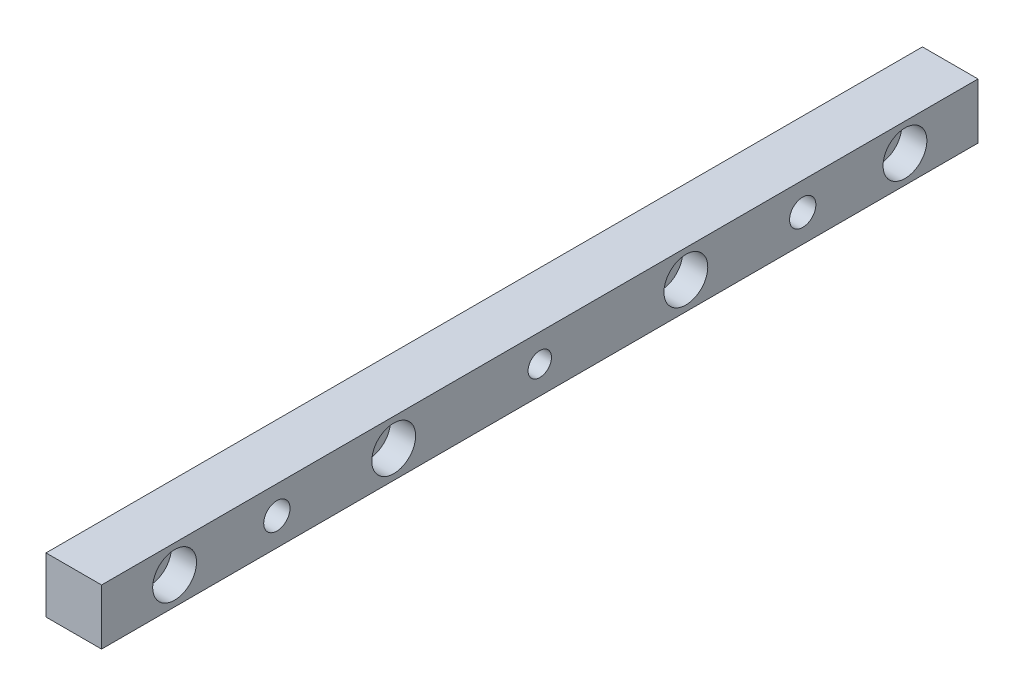
ISO-10303-21;
HEADER;
FILE_DESCRIPTION(('STEP AP214'),'2;1');
FILE_NAME('part.step','',(''),(''),'','','');
FILE_SCHEMA(('AUTOMOTIVE_DESIGN { 1 0 10303 214 1 1 1 1 }'));
ENDSEC;
DATA;
#1=APPLICATION_CONTEXT('core data for automotive mechanical design processes');
#2=APPLICATION_PROTOCOL_DEFINITION('international standard','automotive_design',2000,#1);
#3=PRODUCT_CONTEXT('',#1,'mechanical');
#4=PRODUCT('Part','Part','',(#3));
#5=PRODUCT_RELATED_PRODUCT_CATEGORY('part','',(#4));
#6=PRODUCT_DEFINITION_FORMATION('','',#4);
#7=PRODUCT_DEFINITION_CONTEXT('part definition',#1,'design');
#8=PRODUCT_DEFINITION('design','',#6,#7);
#9=PRODUCT_DEFINITION_SHAPE('','',#8);
#10=(LENGTH_UNIT() NAMED_UNIT(*) SI_UNIT(.MILLI.,.METRE.));
#11=(NAMED_UNIT(*) PLANE_ANGLE_UNIT() SI_UNIT($,.RADIAN.));
#12=(NAMED_UNIT(*) SI_UNIT($,.STERADIAN.) SOLID_ANGLE_UNIT());
#13=UNCERTAINTY_MEASURE_WITH_UNIT(LENGTH_MEASURE(1.E-05),#10,'distance_accuracy_value','');
#14=(GEOMETRIC_REPRESENTATION_CONTEXT(3) GLOBAL_UNCERTAINTY_ASSIGNED_CONTEXT((#13)) GLOBAL_UNIT_ASSIGNED_CONTEXT((#10,
#11,#12)) REPRESENTATION_CONTEXT('',''));
#15=CARTESIAN_POINT('',(0.,0.,0.));
#16=DIRECTION('',(0.,0.,1.));
#17=DIRECTION('',(1.,0.,0.));
#18=AXIS2_PLACEMENT_3D('',#15,#16,#17);
#19=CARTESIAN_POINT('',(19.02,3.19,0.));
#20=DIRECTION('',(-1.,0.,0.));
#21=DIRECTION('',(0.,0.,1.));
#22=AXIS2_PLACEMENT_3D('',#19,#20,#21);
#23=CYLINDRICAL_SURFACE('',#22,4.);
#24=CARTESIAN_POINT('',(19.02,3.19,0.));
#25=DIRECTION('',(-1.,0.,0.));
#26=DIRECTION('',(0.,0.,1.));
#27=AXIS2_PLACEMENT_3D('',#24,#25,#26);
#28=CIRCLE('',#27,4.);
#29=CARTESIAN_POINT('',(19.02,3.19,4.));
#30=VERTEX_POINT('',#29);
#31=EDGE_CURVE('E168',#30,#30,#28,.T.);
#32=ORIENTED_EDGE('',*,*,#31,.F.);
#33=EDGE_LOOP('',(#32));
#34=FACE_BOUND('',#33,.T.);
#35=CARTESIAN_POINT('',(8.6,3.19,0.));
#36=DIRECTION('',(-1.,0.,0.));
#37=DIRECTION('',(0.,0.,1.));
#38=AXIS2_PLACEMENT_3D('',#35,#36,#37);
#39=CIRCLE('',#38,4.);
#40=CARTESIAN_POINT('',(8.6,3.19,4.));
#41=VERTEX_POINT('',#40);
#42=EDGE_CURVE('E45',#41,#41,#39,.F.);
#43=ORIENTED_EDGE('',*,*,#42,.F.);
#44=EDGE_LOOP('',(#43));
#45=FACE_BOUND('',#44,.T.);
#46=ADVANCED_FACE('F41',(#34,#45),#23,.F.);
#47=CARTESIAN_POINT('',(19.02,0.,0.));
#48=DIRECTION('',(-1.,0.,0.));
#49=DIRECTION('',(0.,0.,1.));
#50=AXIS2_PLACEMENT_3D('',#47,#48,#49);
#51=PLANE('',#50);
#52=CARTESIAN_POINT('',(19.02,3.19,-90.));
#53=DIRECTION('',(-1.,0.,0.));
#54=DIRECTION('',(0.,0.,1.));
#55=AXIS2_PLACEMENT_3D('',#52,#53,#54);
#56=CIRCLE('',#55,4.5);
#57=CARTESIAN_POINT('',(19.02,3.19,-85.5));
#58=VERTEX_POINT('',#57);
#59=EDGE_CURVE('E183',#58,#58,#56,.T.);
#60=ORIENTED_EDGE('',*,*,#59,.T.);
#61=EDGE_LOOP('',(#60));
#62=FACE_BOUND('',#61,.T.);
#63=CARTESIAN_POINT('',(19.02,3.19,90.));
#64=DIRECTION('',(-1.,0.,0.));
#65=DIRECTION('',(0.,0.,1.));
#66=AXIS2_PLACEMENT_3D('',#63,#64,#65);
#67=CIRCLE('',#66,4.5);
#68=CARTESIAN_POINT('',(19.02,3.19,94.5));
#69=VERTEX_POINT('',#68);
#70=EDGE_CURVE('E171',#69,#69,#67,.T.);
#71=ORIENTED_EDGE('',*,*,#70,.T.);
#72=EDGE_LOOP('',(#71));
#73=FACE_BOUND('',#72,.T.);
#74=ORIENTED_EDGE('',*,*,#31,.T.);
#75=EDGE_LOOP('',(#74));
#76=FACE_BOUND('',#75,.T.);
#77=CARTESIAN_POINT('',(19.02,3.19,125.));
#78=DIRECTION('',(1.,0.,0.));
#79=DIRECTION('',(0.,0.,-1.));
#80=AXIS2_PLACEMENT_3D('',#77,#78,#79);
#81=CIRCLE('',#80,7.5);
#82=CARTESIAN_POINT('',(19.02,3.19,117.5));
#83=VERTEX_POINT('',#82);
#84=EDGE_CURVE('E165',#83,#83,#81,.T.);
#85=ORIENTED_EDGE('',*,*,#84,.F.);
#86=EDGE_LOOP('',(#85));
#87=FACE_BOUND('',#86,.T.);
#88=CARTESIAN_POINT('',(19.02,3.19,50.));
#89=DIRECTION('',(1.,0.,0.));
#90=DIRECTION('',(0.,0.,-1.));
#91=AXIS2_PLACEMENT_3D('',#88,#89,#90);
#92=CIRCLE('',#91,7.5);
#93=CARTESIAN_POINT('',(19.02,3.19,42.5));
#94=VERTEX_POINT('',#93);
#95=EDGE_CURVE('E153',#94,#94,#92,.T.);
#96=ORIENTED_EDGE('',*,*,#95,.F.);
#97=EDGE_LOOP('',(#96));
#98=FACE_BOUND('',#97,.T.);
#99=CARTESIAN_POINT('',(19.02,3.19,-50.));
#100=DIRECTION('',(1.,0.,0.));
#101=DIRECTION('',(0.,0.,-1.));
#102=AXIS2_PLACEMENT_3D('',#99,#100,#101);
#103=CIRCLE('',#102,7.5);
#104=CARTESIAN_POINT('',(19.02,3.19,-57.5));
#105=VERTEX_POINT('',#104);
#106=EDGE_CURVE('E141',#105,#105,#103,.T.);
#107=ORIENTED_EDGE('',*,*,#106,.F.);
#108=EDGE_LOOP('',(#107));
#109=FACE_BOUND('',#108,.T.);
#110=CARTESIAN_POINT('',(19.02,3.19,-125.));
#111=DIRECTION('',(1.,0.,0.));
#112=DIRECTION('',(0.,0.,-1.));
#113=AXIS2_PLACEMENT_3D('',#110,#111,#112);
#114=CIRCLE('',#113,7.5);
#115=CARTESIAN_POINT('',(19.02,3.19,-132.5));
#116=VERTEX_POINT('',#115);
#117=EDGE_CURVE('E129',#116,#116,#114,.T.);
#118=ORIENTED_EDGE('',*,*,#117,.F.);
#119=EDGE_LOOP('',(#118));
#120=FACE_BOUND('',#119,.T.);
#121=DIRECTION('',(0.,1.,0.));
#122=VECTOR('',#121,1.);
#123=CARTESIAN_POINT('',(19.02,-6.32,-150.));
#124=LINE('',#123,#122);
#125=CARTESIAN_POINT('',(19.02,-6.32,-150.));
#126=VERTEX_POINT('',#125);
#127=CARTESIAN_POINT('',(19.02,12.7,-150.));
#128=VERTEX_POINT('',#127);
#129=EDGE_CURVE('E94',#126,#128,#124,.T.);
#130=ORIENTED_EDGE('',*,*,#129,.T.);
#131=DIRECTION('',(0.,0.,1.));
#132=VECTOR('',#131,1.);
#133=CARTESIAN_POINT('',(19.02,12.7,150.));
#134=LINE('',#133,#132);
#135=CARTESIAN_POINT('',(19.02,12.7,150.));
#136=VERTEX_POINT('',#135);
#137=EDGE_CURVE('E89',#128,#136,#134,.T.);
#138=ORIENTED_EDGE('',*,*,#137,.T.);
#139=DIRECTION('',(0.,-1.,0.));
#140=VECTOR('',#139,1.);
#141=CARTESIAN_POINT('',(19.02,-6.32,150.));
#142=LINE('',#141,#140);
#143=CARTESIAN_POINT('',(19.02,-6.32,150.));
#144=VERTEX_POINT('',#143);
#145=EDGE_CURVE('E92',#136,#144,#142,.T.);
#146=ORIENTED_EDGE('',*,*,#145,.T.);
#147=DIRECTION('',(0.,0.,-1.));
#148=VECTOR('',#147,1.);
#149=CARTESIAN_POINT('',(19.02,-6.32,150.));
#150=LINE('',#149,#148);
#151=EDGE_CURVE('E59',#144,#126,#150,.T.);
#152=ORIENTED_EDGE('',*,*,#151,.T.);
#153=EDGE_LOOP('',(#130,#138,#146,#152));
#154=FACE_BOUND('',#153,.T.);
#155=ADVANCED_FACE('F90',(#62,#73,#76,#87,#98,#109,#120,#154),#51,.F.);
#156=CARTESIAN_POINT('',(0.,0.,0.));
#157=DIRECTION('',(-1.,0.,0.));
#158=DIRECTION('',(0.,0.,1.));
#159=AXIS2_PLACEMENT_3D('',#156,#157,#158);
#160=PLANE('',#159);
#161=CARTESIAN_POINT('',(0.,3.19,0.));
#162=DIRECTION('',(-1.,0.,0.));
#163=DIRECTION('',(0.,0.,1.));
#164=AXIS2_PLACEMENT_3D('',#161,#162,#163);
#165=CIRCLE('',#164,7.5);
#166=CARTESIAN_POINT('',(0.,3.19,7.5));
#167=VERTEX_POINT('',#166);
#168=EDGE_CURVE('E195',#167,#167,#165,.T.);
#169=ORIENTED_EDGE('',*,*,#168,.F.);
#170=EDGE_LOOP('',(#169));
#171=FACE_BOUND('',#170,.T.);
#172=CARTESIAN_POINT('',(0.,3.19,-90.));
#173=DIRECTION('',(-1.,0.,0.));
#174=DIRECTION('',(0.,0.,1.));
#175=AXIS2_PLACEMENT_3D('',#172,#173,#174);
#176=CIRCLE('',#175,7.5);
#177=CARTESIAN_POINT('',(0.,3.19,-82.5));
#178=VERTEX_POINT('',#177);
#179=EDGE_CURVE('E192',#178,#178,#176,.T.);
#180=ORIENTED_EDGE('',*,*,#179,.F.);
#181=EDGE_LOOP('',(#180));
#182=FACE_BOUND('',#181,.T.);
#183=CARTESIAN_POINT('',(0.,3.19,90.));
#184=DIRECTION('',(-1.,0.,0.));
#185=DIRECTION('',(0.,0.,1.));
#186=AXIS2_PLACEMENT_3D('',#183,#184,#185);
#187=CIRCLE('',#186,7.5);
#188=CARTESIAN_POINT('',(0.,3.19,97.5));
#189=VERTEX_POINT('',#188);
#190=EDGE_CURVE('E180',#189,#189,#187,.T.);
#191=ORIENTED_EDGE('',*,*,#190,.F.);
#192=EDGE_LOOP('',(#191));
#193=FACE_BOUND('',#192,.T.);
#194=CARTESIAN_POINT('',(0.,3.19,125.));
#195=DIRECTION('',(1.,0.,0.));
#196=DIRECTION('',(0.,0.,-1.));
#197=AXIS2_PLACEMENT_3D('',#194,#195,#196);
#198=CIRCLE('',#197,4.5);
#199=CARTESIAN_POINT('',(0.,3.19,120.5));
#200=VERTEX_POINT('',#199);
#201=EDGE_CURVE('E156',#200,#200,#198,.T.);
#202=ORIENTED_EDGE('',*,*,#201,.T.);
#203=EDGE_LOOP('',(#202));
#204=FACE_BOUND('',#203,.T.);
#205=CARTESIAN_POINT('',(0.,3.19,50.));
#206=DIRECTION('',(1.,0.,0.));
#207=DIRECTION('',(0.,0.,-1.));
#208=AXIS2_PLACEMENT_3D('',#205,#206,#207);
#209=CIRCLE('',#208,4.5);
#210=CARTESIAN_POINT('',(0.,3.19,45.5));
#211=VERTEX_POINT('',#210);
#212=EDGE_CURVE('E144',#211,#211,#209,.T.);
#213=ORIENTED_EDGE('',*,*,#212,.T.);
#214=EDGE_LOOP('',(#213));
#215=FACE_BOUND('',#214,.T.);
#216=CARTESIAN_POINT('',(0.,3.19,-50.));
#217=DIRECTION('',(1.,0.,0.));
#218=DIRECTION('',(0.,0.,-1.));
#219=AXIS2_PLACEMENT_3D('',#216,#217,#218);
#220=CIRCLE('',#219,4.5);
#221=CARTESIAN_POINT('',(0.,3.19,-54.5));
#222=VERTEX_POINT('',#221);
#223=EDGE_CURVE('E132',#222,#222,#220,.T.);
#224=ORIENTED_EDGE('',*,*,#223,.T.);
#225=EDGE_LOOP('',(#224));
#226=FACE_BOUND('',#225,.T.);
#227=CARTESIAN_POINT('',(0.,3.19,-125.));
#228=DIRECTION('',(1.,0.,0.));
#229=DIRECTION('',(0.,0.,-1.));
#230=AXIS2_PLACEMENT_3D('',#227,#228,#229);
#231=CIRCLE('',#230,4.5);
#232=CARTESIAN_POINT('',(0.,3.19,-129.5));
#233=VERTEX_POINT('',#232);
#234=EDGE_CURVE('E110',#233,#233,#231,.T.);
#235=ORIENTED_EDGE('',*,*,#234,.T.);
#236=EDGE_LOOP('',(#235));
#237=FACE_BOUND('',#236,.T.);
#238=DIRECTION('',(0.,1.,0.));
#239=VECTOR('',#238,1.);
#240=CARTESIAN_POINT('',(0.,-6.32,-150.));
#241=LINE('',#240,#239);
#242=CARTESIAN_POINT('',(0.,-6.32,-150.));
#243=VERTEX_POINT('',#242);
#244=CARTESIAN_POINT('',(0.,12.7,-150.));
#245=VERTEX_POINT('',#244);
#246=EDGE_CURVE('E107',#243,#245,#241,.T.);
#247=ORIENTED_EDGE('',*,*,#246,.F.);
#248=DIRECTION('',(0.,0.,-1.));
#249=VECTOR('',#248,1.);
#250=CARTESIAN_POINT('',(0.,-6.32,150.));
#251=LINE('',#250,#249);
#252=CARTESIAN_POINT('',(0.,-6.32,150.));
#253=VERTEX_POINT('',#252);
#254=EDGE_CURVE('E82',#253,#243,#251,.T.);
#255=ORIENTED_EDGE('',*,*,#254,.F.);
#256=DIRECTION('',(0.,-1.,0.));
#257=VECTOR('',#256,1.);
#258=CARTESIAN_POINT('',(0.,-6.32,150.));
#259=LINE('',#258,#257);
#260=CARTESIAN_POINT('',(0.,12.7,150.));
#261=VERTEX_POINT('',#260);
#262=EDGE_CURVE('E76',#261,#253,#259,.T.);
#263=ORIENTED_EDGE('',*,*,#262,.F.);
#264=DIRECTION('',(0.,0.,1.));
#265=VECTOR('',#264,1.);
#266=CARTESIAN_POINT('',(0.,12.7,150.));
#267=LINE('',#266,#265);
#268=EDGE_CURVE('E98',#245,#261,#267,.T.);
#269=ORIENTED_EDGE('',*,*,#268,.F.);
#270=EDGE_LOOP('',(#247,#255,#263,#269));
#271=FACE_BOUND('',#270,.T.);
#272=ADVANCED_FACE('F118',(#171,#182,#193,#204,#215,#226,#237,#271),#160,.T.);
#273=CARTESIAN_POINT('',(19.02,-6.32,-150.));
#274=DIRECTION('',(0.,0.,1.));
#275=DIRECTION('',(1.,0.,0.));
#276=AXIS2_PLACEMENT_3D('',#273,#274,#275);
#277=PLANE('',#276);
#278=ORIENTED_EDGE('',*,*,#246,.T.);
#279=DIRECTION('',(-1.,0.,0.));
#280=VECTOR('',#279,1.);
#281=CARTESIAN_POINT('',(19.02,12.7,-150.));
#282=LINE('',#281,#280);
#283=EDGE_CURVE('E11',#128,#245,#282,.T.);
#284=ORIENTED_EDGE('',*,*,#283,.F.);
#285=ORIENTED_EDGE('',*,*,#129,.F.);
#286=DIRECTION('',(-1.,0.,0.));
#287=VECTOR('',#286,1.);
#288=CARTESIAN_POINT('',(19.02,-6.32,-150.));
#289=LINE('',#288,#287);
#290=EDGE_CURVE('E103',#126,#243,#289,.T.);
#291=ORIENTED_EDGE('',*,*,#290,.T.);
#292=EDGE_LOOP('',(#278,#284,#285,#291));
#293=FACE_BOUND('',#292,.T.);
#294=ADVANCED_FACE('F43',(#293),#277,.F.);
#295=CARTESIAN_POINT('',(19.02,12.7,150.));
#296=DIRECTION('',(0.,-1.,0.));
#297=DIRECTION('',(0.,0.,-1.));
#298=AXIS2_PLACEMENT_3D('',#295,#296,#297);
#299=PLANE('',#298);
#300=ORIENTED_EDGE('',*,*,#268,.T.);
#301=DIRECTION('',(-1.,0.,0.));
#302=VECTOR('',#301,1.);
#303=CARTESIAN_POINT('',(19.02,12.7,150.));
#304=LINE('',#303,#302);
#305=EDGE_CURVE('E51',#136,#261,#304,.T.);
#306=ORIENTED_EDGE('',*,*,#305,.F.);
#307=ORIENTED_EDGE('',*,*,#137,.F.);
#308=ORIENTED_EDGE('',*,*,#283,.T.);
#309=EDGE_LOOP('',(#300,#306,#307,#308));
#310=FACE_BOUND('',#309,.T.);
#311=ADVANCED_FACE('F97',(#310),#299,.F.);
#312=CARTESIAN_POINT('',(19.02,-6.32,150.));
#313=DIRECTION('',(0.,0.,-1.));
#314=DIRECTION('',(-1.,0.,0.));
#315=AXIS2_PLACEMENT_3D('',#312,#313,#314);
#316=PLANE('',#315);
#317=ORIENTED_EDGE('',*,*,#262,.T.);
#318=DIRECTION('',(-1.,0.,0.));
#319=VECTOR('',#318,1.);
#320=CARTESIAN_POINT('',(19.02,-6.32,150.));
#321=LINE('',#320,#319);
#322=EDGE_CURVE('E99',#144,#253,#321,.T.);
#323=ORIENTED_EDGE('',*,*,#322,.F.);
#324=ORIENTED_EDGE('',*,*,#145,.F.);
#325=ORIENTED_EDGE('',*,*,#305,.T.);
#326=EDGE_LOOP('',(#317,#323,#324,#325));
#327=FACE_BOUND('',#326,.T.);
#328=ADVANCED_FACE('F101',(#327),#316,.F.);
#329=CARTESIAN_POINT('',(19.02,-6.32,150.));
#330=DIRECTION('',(0.,1.,0.));
#331=DIRECTION('',(0.,0.,1.));
#332=AXIS2_PLACEMENT_3D('',#329,#330,#331);
#333=PLANE('',#332);
#334=ORIENTED_EDGE('',*,*,#254,.T.);
#335=ORIENTED_EDGE('',*,*,#290,.F.);
#336=ORIENTED_EDGE('',*,*,#151,.F.);
#337=ORIENTED_EDGE('',*,*,#322,.T.);
#338=EDGE_LOOP('',(#334,#335,#336,#337));
#339=FACE_BOUND('',#338,.T.);
#340=ADVANCED_FACE('F115',(#339),#333,.F.);
#341=CARTESIAN_POINT('',(19.02,3.19,-125.));
#342=DIRECTION('',(1.,0.,0.));
#343=DIRECTION('',(0.,0.,-1.));
#344=AXIS2_PLACEMENT_3D('',#341,#342,#343);
#345=CYLINDRICAL_SURFACE('',#344,4.5);
#346=ORIENTED_EDGE('',*,*,#234,.F.);
#347=EDGE_LOOP('',(#346));
#348=FACE_BOUND('',#347,.T.);
#349=CARTESIAN_POINT('',(10.42,3.19,-125.));
#350=DIRECTION('',(1.,0.,0.));
#351=DIRECTION('',(0.,0.,-1.));
#352=AXIS2_PLACEMENT_3D('',#349,#350,#351);
#353=CIRCLE('',#352,4.5);
#354=CARTESIAN_POINT('',(10.42,3.19,-129.5));
#355=VERTEX_POINT('',#354);
#356=EDGE_CURVE('E123',#355,#355,#353,.T.);
#357=ORIENTED_EDGE('',*,*,#356,.T.);
#358=EDGE_LOOP('',(#357));
#359=FACE_BOUND('',#358,.T.);
#360=ADVANCED_FACE('F263',(#348,#359),#345,.F.);
#361=CARTESIAN_POINT('',(10.42,7.69,-125.));
#362=DIRECTION('',(-1.,0.,0.));
#363=DIRECTION('',(0.,0.,1.));
#364=AXIS2_PLACEMENT_3D('',#361,#362,#363);
#365=PLANE('',#364);
#366=ORIENTED_EDGE('',*,*,#356,.F.);
#367=EDGE_LOOP('',(#366));
#368=FACE_BOUND('',#367,.T.);
#369=CARTESIAN_POINT('',(10.42,3.19,-125.));
#370=DIRECTION('',(1.,0.,0.));
#371=DIRECTION('',(0.,0.,-1.));
#372=AXIS2_PLACEMENT_3D('',#369,#370,#371);
#373=CIRCLE('',#372,7.5);
#374=CARTESIAN_POINT('',(10.42,3.19,-132.5));
#375=VERTEX_POINT('',#374);
#376=EDGE_CURVE('E126',#375,#375,#373,.T.);
#377=ORIENTED_EDGE('',*,*,#376,.T.);
#378=EDGE_LOOP('',(#377));
#379=FACE_BOUND('',#378,.T.);
#380=ADVANCED_FACE('F259',(#368,#379),#365,.F.);
#381=CARTESIAN_POINT('',(19.02,3.19,-125.));
#382=DIRECTION('',(1.,0.,0.));
#383=DIRECTION('',(0.,0.,-1.));
#384=AXIS2_PLACEMENT_3D('',#381,#382,#383);
#385=CYLINDRICAL_SURFACE('',#384,7.5);
#386=ORIENTED_EDGE('',*,*,#376,.F.);
#387=EDGE_LOOP('',(#386));
#388=FACE_BOUND('',#387,.T.);
#389=ORIENTED_EDGE('',*,*,#117,.T.);
#390=EDGE_LOOP('',(#389));
#391=FACE_BOUND('',#390,.T.);
#392=ADVANCED_FACE('F255',(#388,#391),#385,.F.);
#393=CARTESIAN_POINT('',(19.02,3.19,-50.));
#394=DIRECTION('',(1.,0.,0.));
#395=DIRECTION('',(0.,0.,-1.));
#396=AXIS2_PLACEMENT_3D('',#393,#394,#395);
#397=CYLINDRICAL_SURFACE('',#396,4.5);
#398=ORIENTED_EDGE('',*,*,#223,.F.);
#399=EDGE_LOOP('',(#398));
#400=FACE_BOUND('',#399,.T.);
#401=CARTESIAN_POINT('',(10.42,3.19,-50.));
#402=DIRECTION('',(1.,0.,0.));
#403=DIRECTION('',(0.,0.,-1.));
#404=AXIS2_PLACEMENT_3D('',#401,#402,#403);
#405=CIRCLE('',#404,4.5);
#406=CARTESIAN_POINT('',(10.42,3.19,-54.5));
#407=VERTEX_POINT('',#406);
#408=EDGE_CURVE('E135',#407,#407,#405,.T.);
#409=ORIENTED_EDGE('',*,*,#408,.T.);
#410=EDGE_LOOP('',(#409));
#411=FACE_BOUND('',#410,.T.);
#412=ADVANCED_FACE('F251',(#400,#411),#397,.F.);
#413=CARTESIAN_POINT('',(10.42,7.69,-50.));
#414=DIRECTION('',(-1.,0.,0.));
#415=DIRECTION('',(0.,0.,1.));
#416=AXIS2_PLACEMENT_3D('',#413,#414,#415);
#417=PLANE('',#416);
#418=ORIENTED_EDGE('',*,*,#408,.F.);
#419=EDGE_LOOP('',(#418));
#420=FACE_BOUND('',#419,.T.);
#421=CARTESIAN_POINT('',(10.42,3.19,-50.));
#422=DIRECTION('',(1.,0.,0.));
#423=DIRECTION('',(0.,0.,-1.));
#424=AXIS2_PLACEMENT_3D('',#421,#422,#423);
#425=CIRCLE('',#424,7.5);
#426=CARTESIAN_POINT('',(10.42,3.19,-57.5));
#427=VERTEX_POINT('',#426);
#428=EDGE_CURVE('E138',#427,#427,#425,.T.);
#429=ORIENTED_EDGE('',*,*,#428,.T.);
#430=EDGE_LOOP('',(#429));
#431=FACE_BOUND('',#430,.T.);
#432=ADVANCED_FACE('F247',(#420,#431),#417,.F.);
#433=CARTESIAN_POINT('',(19.02,3.19,-50.));
#434=DIRECTION('',(1.,0.,0.));
#435=DIRECTION('',(0.,0.,-1.));
#436=AXIS2_PLACEMENT_3D('',#433,#434,#435);
#437=CYLINDRICAL_SURFACE('',#436,7.5);
#438=ORIENTED_EDGE('',*,*,#428,.F.);
#439=EDGE_LOOP('',(#438));
#440=FACE_BOUND('',#439,.T.);
#441=ORIENTED_EDGE('',*,*,#106,.T.);
#442=EDGE_LOOP('',(#441));
#443=FACE_BOUND('',#442,.T.);
#444=ADVANCED_FACE('F243',(#440,#443),#437,.F.);
#445=CARTESIAN_POINT('',(19.02,3.19,50.));
#446=DIRECTION('',(1.,0.,0.));
#447=DIRECTION('',(0.,0.,-1.));
#448=AXIS2_PLACEMENT_3D('',#445,#446,#447);
#449=CYLINDRICAL_SURFACE('',#448,4.5);
#450=ORIENTED_EDGE('',*,*,#212,.F.);
#451=EDGE_LOOP('',(#450));
#452=FACE_BOUND('',#451,.T.);
#453=CARTESIAN_POINT('',(10.42,3.19,50.));
#454=DIRECTION('',(1.,0.,0.));
#455=DIRECTION('',(0.,0.,-1.));
#456=AXIS2_PLACEMENT_3D('',#453,#454,#455);
#457=CIRCLE('',#456,4.5);
#458=CARTESIAN_POINT('',(10.42,3.19,45.5));
#459=VERTEX_POINT('',#458);
#460=EDGE_CURVE('E147',#459,#459,#457,.T.);
#461=ORIENTED_EDGE('',*,*,#460,.T.);
#462=EDGE_LOOP('',(#461));
#463=FACE_BOUND('',#462,.T.);
#464=ADVANCED_FACE('F239',(#452,#463),#449,.F.);
#465=CARTESIAN_POINT('',(10.42,7.69,50.));
#466=DIRECTION('',(-1.,0.,0.));
#467=DIRECTION('',(0.,0.,1.));
#468=AXIS2_PLACEMENT_3D('',#465,#466,#467);
#469=PLANE('',#468);
#470=ORIENTED_EDGE('',*,*,#460,.F.);
#471=EDGE_LOOP('',(#470));
#472=FACE_BOUND('',#471,.T.);
#473=CARTESIAN_POINT('',(10.42,3.19,50.));
#474=DIRECTION('',(1.,0.,0.));
#475=DIRECTION('',(0.,0.,-1.));
#476=AXIS2_PLACEMENT_3D('',#473,#474,#475);
#477=CIRCLE('',#476,7.5);
#478=CARTESIAN_POINT('',(10.42,3.19,42.5));
#479=VERTEX_POINT('',#478);
#480=EDGE_CURVE('E150',#479,#479,#477,.T.);
#481=ORIENTED_EDGE('',*,*,#480,.T.);
#482=EDGE_LOOP('',(#481));
#483=FACE_BOUND('',#482,.T.);
#484=ADVANCED_FACE('F235',(#472,#483),#469,.F.);
#485=CARTESIAN_POINT('',(19.02,3.19,50.));
#486=DIRECTION('',(1.,0.,0.));
#487=DIRECTION('',(0.,0.,-1.));
#488=AXIS2_PLACEMENT_3D('',#485,#486,#487);
#489=CYLINDRICAL_SURFACE('',#488,7.5);
#490=ORIENTED_EDGE('',*,*,#480,.F.);
#491=EDGE_LOOP('',(#490));
#492=FACE_BOUND('',#491,.T.);
#493=ORIENTED_EDGE('',*,*,#95,.T.);
#494=EDGE_LOOP('',(#493));
#495=FACE_BOUND('',#494,.T.);
#496=ADVANCED_FACE('F231',(#492,#495),#489,.F.);
#497=CARTESIAN_POINT('',(19.02,3.19,125.));
#498=DIRECTION('',(1.,0.,0.));
#499=DIRECTION('',(0.,0.,-1.));
#500=AXIS2_PLACEMENT_3D('',#497,#498,#499);
#501=CYLINDRICAL_SURFACE('',#500,4.5);
#502=ORIENTED_EDGE('',*,*,#201,.F.);
#503=EDGE_LOOP('',(#502));
#504=FACE_BOUND('',#503,.T.);
#505=CARTESIAN_POINT('',(10.42,3.19,125.));
#506=DIRECTION('',(1.,0.,0.));
#507=DIRECTION('',(0.,0.,-1.));
#508=AXIS2_PLACEMENT_3D('',#505,#506,#507);
#509=CIRCLE('',#508,4.5);
#510=CARTESIAN_POINT('',(10.42,3.19,120.5));
#511=VERTEX_POINT('',#510);
#512=EDGE_CURVE('E159',#511,#511,#509,.T.);
#513=ORIENTED_EDGE('',*,*,#512,.T.);
#514=EDGE_LOOP('',(#513));
#515=FACE_BOUND('',#514,.T.);
#516=ADVANCED_FACE('F227',(#504,#515),#501,.F.);
#517=CARTESIAN_POINT('',(10.42,7.69,125.));
#518=DIRECTION('',(-1.,0.,0.));
#519=DIRECTION('',(0.,0.,1.));
#520=AXIS2_PLACEMENT_3D('',#517,#518,#519);
#521=PLANE('',#520);
#522=ORIENTED_EDGE('',*,*,#512,.F.);
#523=EDGE_LOOP('',(#522));
#524=FACE_BOUND('',#523,.T.);
#525=CARTESIAN_POINT('',(10.42,3.19,125.));
#526=DIRECTION('',(1.,0.,0.));
#527=DIRECTION('',(0.,0.,-1.));
#528=AXIS2_PLACEMENT_3D('',#525,#526,#527);
#529=CIRCLE('',#528,7.5);
#530=CARTESIAN_POINT('',(10.42,3.19,117.5));
#531=VERTEX_POINT('',#530);
#532=EDGE_CURVE('E162',#531,#531,#529,.T.);
#533=ORIENTED_EDGE('',*,*,#532,.T.);
#534=EDGE_LOOP('',(#533));
#535=FACE_BOUND('',#534,.T.);
#536=ADVANCED_FACE('F223',(#524,#535),#521,.F.);
#537=CARTESIAN_POINT('',(19.02,3.19,125.));
#538=DIRECTION('',(1.,0.,0.));
#539=DIRECTION('',(0.,0.,-1.));
#540=AXIS2_PLACEMENT_3D('',#537,#538,#539);
#541=CYLINDRICAL_SURFACE('',#540,7.5);
#542=ORIENTED_EDGE('',*,*,#532,.F.);
#543=EDGE_LOOP('',(#542));
#544=FACE_BOUND('',#543,.T.);
#545=ORIENTED_EDGE('',*,*,#84,.T.);
#546=EDGE_LOOP('',(#545));
#547=FACE_BOUND('',#546,.T.);
#548=ADVANCED_FACE('F220',(#544,#547),#541,.F.);
#549=CARTESIAN_POINT('',(0.,3.19,90.));
#550=DIRECTION('',(-1.,0.,0.));
#551=DIRECTION('',(0.,0.,1.));
#552=AXIS2_PLACEMENT_3D('',#549,#550,#551);
#553=CYLINDRICAL_SURFACE('',#552,4.5);
#554=ORIENTED_EDGE('',*,*,#70,.F.);
#555=EDGE_LOOP('',(#554));
#556=FACE_BOUND('',#555,.T.);
#557=CARTESIAN_POINT('',(8.6,3.19,90.));
#558=DIRECTION('',(-1.,0.,0.));
#559=DIRECTION('',(0.,0.,1.));
#560=AXIS2_PLACEMENT_3D('',#557,#558,#559);
#561=CIRCLE('',#560,4.5);
#562=CARTESIAN_POINT('',(8.6,3.19,94.5));
#563=VERTEX_POINT('',#562);
#564=EDGE_CURVE('E174',#563,#563,#561,.T.);
#565=ORIENTED_EDGE('',*,*,#564,.T.);
#566=EDGE_LOOP('',(#565));
#567=FACE_BOUND('',#566,.T.);
#568=ADVANCED_FACE('F218',(#556,#567),#553,.F.);
#569=CARTESIAN_POINT('',(8.6,7.69,90.));
#570=DIRECTION('',(1.,0.,0.));
#571=DIRECTION('',(0.,0.,-1.));
#572=AXIS2_PLACEMENT_3D('',#569,#570,#571);
#573=PLANE('',#572);
#574=ORIENTED_EDGE('',*,*,#564,.F.);
#575=EDGE_LOOP('',(#574));
#576=FACE_BOUND('',#575,.T.);
#577=CARTESIAN_POINT('',(8.6,3.19,90.));
#578=DIRECTION('',(-1.,0.,0.));
#579=DIRECTION('',(0.,0.,1.));
#580=AXIS2_PLACEMENT_3D('',#577,#578,#579);
#581=CIRCLE('',#580,7.5);
#582=CARTESIAN_POINT('',(8.6,3.19,97.5));
#583=VERTEX_POINT('',#582);
#584=EDGE_CURVE('E177',#583,#583,#581,.T.);
#585=ORIENTED_EDGE('',*,*,#584,.T.);
#586=EDGE_LOOP('',(#585));
#587=FACE_BOUND('',#586,.T.);
#588=ADVANCED_FACE('F311',(#576,#587),#573,.F.);
#589=CARTESIAN_POINT('',(0.,3.19,90.));
#590=DIRECTION('',(-1.,0.,0.));
#591=DIRECTION('',(0.,0.,1.));
#592=AXIS2_PLACEMENT_3D('',#589,#590,#591);
#593=CYLINDRICAL_SURFACE('',#592,7.5);
#594=ORIENTED_EDGE('',*,*,#584,.F.);
#595=EDGE_LOOP('',(#594));
#596=FACE_BOUND('',#595,.T.);
#597=ORIENTED_EDGE('',*,*,#190,.T.);
#598=EDGE_LOOP('',(#597));
#599=FACE_BOUND('',#598,.T.);
#600=ADVANCED_FACE('F320',(#596,#599),#593,.F.);
#601=CARTESIAN_POINT('',(0.,3.19,-90.));
#602=DIRECTION('',(-1.,0.,0.));
#603=DIRECTION('',(0.,0.,1.));
#604=AXIS2_PLACEMENT_3D('',#601,#602,#603);
#605=CYLINDRICAL_SURFACE('',#604,4.5);
#606=ORIENTED_EDGE('',*,*,#59,.F.);
#607=EDGE_LOOP('',(#606));
#608=FACE_BOUND('',#607,.T.);
#609=CARTESIAN_POINT('',(8.6,3.19,-90.));
#610=DIRECTION('',(-1.,0.,0.));
#611=DIRECTION('',(0.,0.,1.));
#612=AXIS2_PLACEMENT_3D('',#609,#610,#611);
#613=CIRCLE('',#612,4.5);
#614=CARTESIAN_POINT('',(8.6,3.19,-85.5));
#615=VERTEX_POINT('',#614);
#616=EDGE_CURVE('E186',#615,#615,#613,.T.);
#617=ORIENTED_EDGE('',*,*,#616,.T.);
#618=EDGE_LOOP('',(#617));
#619=FACE_BOUND('',#618,.T.);
#620=ADVANCED_FACE('F298',(#608,#619),#605,.F.);
#621=CARTESIAN_POINT('',(8.6,7.69,-90.));
#622=DIRECTION('',(1.,0.,0.));
#623=DIRECTION('',(0.,0.,-1.));
#624=AXIS2_PLACEMENT_3D('',#621,#622,#623);
#625=PLANE('',#624);
#626=ORIENTED_EDGE('',*,*,#616,.F.);
#627=EDGE_LOOP('',(#626));
#628=FACE_BOUND('',#627,.T.);
#629=CARTESIAN_POINT('',(8.6,3.19,-90.));
#630=DIRECTION('',(-1.,0.,0.));
#631=DIRECTION('',(0.,0.,1.));
#632=AXIS2_PLACEMENT_3D('',#629,#630,#631);
#633=CIRCLE('',#632,7.5);
#634=CARTESIAN_POINT('',(8.6,3.19,-82.5));
#635=VERTEX_POINT('',#634);
#636=EDGE_CURVE('E189',#635,#635,#633,.T.);
#637=ORIENTED_EDGE('',*,*,#636,.T.);
#638=EDGE_LOOP('',(#637));
#639=FACE_BOUND('',#638,.T.);
#640=ADVANCED_FACE('F319',(#628,#639),#625,.F.);
#641=CARTESIAN_POINT('',(0.,3.19,-90.));
#642=DIRECTION('',(-1.,0.,0.));
#643=DIRECTION('',(0.,0.,1.));
#644=AXIS2_PLACEMENT_3D('',#641,#642,#643);
#645=CYLINDRICAL_SURFACE('',#644,7.5);
#646=ORIENTED_EDGE('',*,*,#636,.F.);
#647=EDGE_LOOP('',(#646));
#648=FACE_BOUND('',#647,.T.);
#649=ORIENTED_EDGE('',*,*,#179,.T.);
#650=EDGE_LOOP('',(#649));
#651=FACE_BOUND('',#650,.T.);
#652=ADVANCED_FACE('F409',(#648,#651),#645,.F.);
#653=CARTESIAN_POINT('',(8.6,3.19,0.));
#654=DIRECTION('',(-1.,0.,0.));
#655=DIRECTION('',(0.,0.,1.));
#656=AXIS2_PLACEMENT_3D('',#653,#654,#655);
#657=PLANE('',#656);
#658=CARTESIAN_POINT('',(8.6,3.19,0.));
#659=DIRECTION('',(-1.,0.,0.));
#660=DIRECTION('',(0.,0.,1.));
#661=AXIS2_PLACEMENT_3D('',#658,#659,#660);
#662=CIRCLE('',#661,7.5);
#663=CARTESIAN_POINT('',(8.6,3.19,7.5));
#664=VERTEX_POINT('',#663);
#665=EDGE_CURVE('E198',#664,#664,#662,.T.);
#666=ORIENTED_EDGE('',*,*,#665,.T.);
#667=EDGE_LOOP('',(#666));
#668=FACE_BOUND('',#667,.T.);
#669=ORIENTED_EDGE('',*,*,#42,.T.);
#670=EDGE_LOOP('',(#669));
#671=FACE_BOUND('',#670,.T.);
#672=ADVANCED_FACE('F205',(#668,#671),#657,.T.);
#673=CARTESIAN_POINT('',(8.6,3.19,0.));
#674=DIRECTION('',(-1.,0.,0.));
#675=DIRECTION('',(0.,0.,1.));
#676=AXIS2_PLACEMENT_3D('',#673,#674,#675);
#677=CYLINDRICAL_SURFACE('',#676,7.5);
#678=ORIENTED_EDGE('',*,*,#665,.F.);
#679=EDGE_LOOP('',(#678));
#680=FACE_BOUND('',#679,.T.);
#681=ORIENTED_EDGE('',*,*,#168,.T.);
#682=EDGE_LOOP('',(#681));
#683=FACE_BOUND('',#682,.T.);
#684=ADVANCED_FACE('F422',(#680,#683),#677,.F.);
#685=CLOSED_SHELL('',(#46,#155,#272,#294,#311,#328,#340,#360,#380,#392,#412,#432,#444,#464,#484,
#496,#516,#536,#548,#568,#588,#600,#620,#640,#652,#672,#684));
#686=MANIFOLD_SOLID_BREP('B2',#685);
#687=ADVANCED_BREP_SHAPE_REPRESENTATION('',(#18,#686),#14);
#688=SHAPE_DEFINITION_REPRESENTATION(#9,#687);
ENDSEC;
END-ISO-10303-21;
